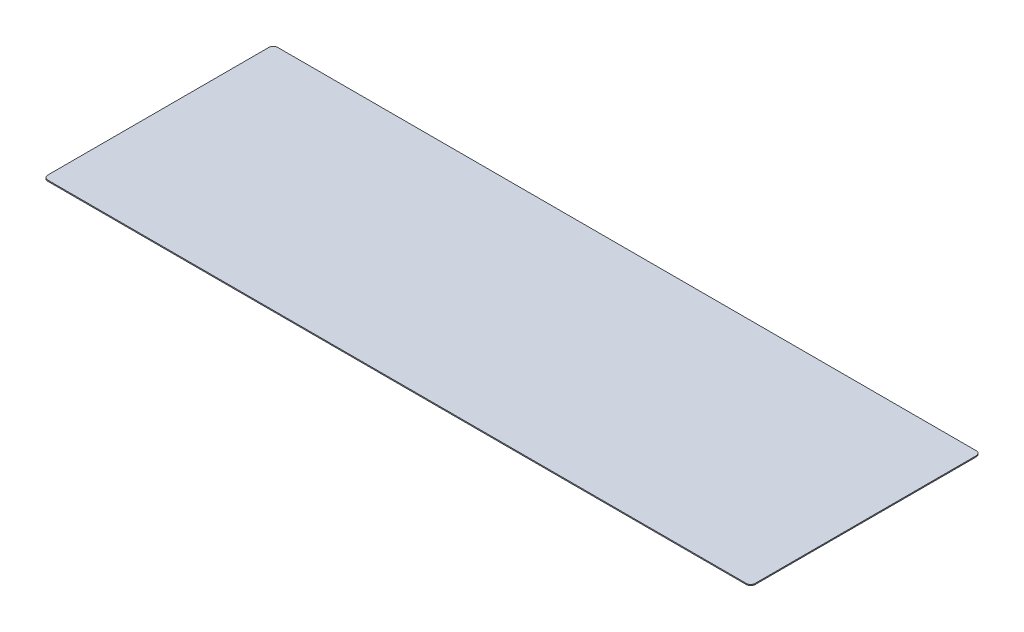
ISO-10303-21;
HEADER;
FILE_DESCRIPTION(('STEP AP214'),'2;1');
FILE_NAME('part.step','',(''),(''),'','','');
FILE_SCHEMA(('AUTOMOTIVE_DESIGN { 1 0 10303 214 1 1 1 1 }'));
ENDSEC;
DATA;
#1=APPLICATION_CONTEXT('core data for automotive mechanical design processes');
#2=APPLICATION_PROTOCOL_DEFINITION('international standard','automotive_design',2000,#1);
#3=PRODUCT_CONTEXT('',#1,'mechanical');
#4=PRODUCT('Part','Part','',(#3));
#5=PRODUCT_RELATED_PRODUCT_CATEGORY('part','',(#4));
#6=PRODUCT_DEFINITION_FORMATION('','',#4);
#7=PRODUCT_DEFINITION_CONTEXT('part definition',#1,'design');
#8=PRODUCT_DEFINITION('design','',#6,#7);
#9=PRODUCT_DEFINITION_SHAPE('','',#8);
#10=(LENGTH_UNIT() NAMED_UNIT(*) SI_UNIT(.MILLI.,.METRE.));
#11=(NAMED_UNIT(*) PLANE_ANGLE_UNIT() SI_UNIT($,.RADIAN.));
#12=(NAMED_UNIT(*) SI_UNIT($,.STERADIAN.) SOLID_ANGLE_UNIT());
#13=UNCERTAINTY_MEASURE_WITH_UNIT(LENGTH_MEASURE(1.E-05),#10,'distance_accuracy_value','');
#14=(GEOMETRIC_REPRESENTATION_CONTEXT(3) GLOBAL_UNCERTAINTY_ASSIGNED_CONTEXT((#13)) GLOBAL_UNIT_ASSIGNED_CONTEXT((#10,
#11,#12)) REPRESENTATION_CONTEXT('',''));
#15=CARTESIAN_POINT('',(0.,0.,0.));
#16=DIRECTION('',(0.,0.,1.));
#17=DIRECTION('',(1.,0.,0.));
#18=AXIS2_PLACEMENT_3D('',#15,#16,#17);
#19=CARTESIAN_POINT('',(1009.65,1.524,-323.85));
#20=DIRECTION('',(0.,-1.,0.));
#21=DIRECTION('',(0.,0.,-1.));
#22=AXIS2_PLACEMENT_3D('',#19,#20,#21);
#23=CYLINDRICAL_SURFACE('',#22,6.35000000000005);
#24=CARTESIAN_POINT('',(1009.65,0.,-323.85));
#25=DIRECTION('',(0.,1.,0.));
#26=DIRECTION('',(0.,0.,-1.));
#27=AXIS2_PLACEMENT_3D('',#24,#25,#26);
#28=CIRCLE('',#27,6.35000000000005);
#29=CARTESIAN_POINT('',(1016.,0.,-323.85));
#30=VERTEX_POINT('',#29);
#31=CARTESIAN_POINT('',(1009.65,0.,-330.2));
#32=VERTEX_POINT('',#31);
#33=EDGE_CURVE('E129',#30,#32,#28,.T.);
#34=ORIENTED_EDGE('',*,*,#33,.T.);
#35=DIRECTION('',(0.,-1.,0.));
#36=VECTOR('',#35,1.);
#37=CARTESIAN_POINT('',(1009.65,1.524,-330.2));
#38=LINE('',#37,#36);
#39=CARTESIAN_POINT('',(1009.65,1.524,-330.2));
#40=VERTEX_POINT('',#39);
#41=EDGE_CURVE('E11',#40,#32,#38,.T.);
#42=ORIENTED_EDGE('',*,*,#41,.F.);
#43=CARTESIAN_POINT('',(1009.65,1.524,-323.85));
#44=DIRECTION('',(0.,1.,0.));
#45=DIRECTION('',(0.,0.,-1.));
#46=AXIS2_PLACEMENT_3D('',#43,#44,#45);
#47=CIRCLE('',#46,6.35000000000005);
#48=CARTESIAN_POINT('',(1016.,1.524,-323.85));
#49=VERTEX_POINT('',#48);
#50=EDGE_CURVE('E143',#49,#40,#47,.T.);
#51=ORIENTED_EDGE('',*,*,#50,.F.);
#52=DIRECTION('',(0.,-1.,0.));
#53=VECTOR('',#52,1.);
#54=CARTESIAN_POINT('',(1016.,1.524,-323.85));
#55=LINE('',#54,#53);
#56=EDGE_CURVE('E125',#49,#30,#55,.T.);
#57=ORIENTED_EDGE('',*,*,#56,.T.);
#58=EDGE_LOOP('',(#34,#42,#51,#57));
#59=FACE_BOUND('',#58,.T.);
#60=ADVANCED_FACE('F33',(#59),#23,.T.);
#61=CARTESIAN_POINT('',(6.35000000000004,1.524,-330.2));
#62=DIRECTION('',(0.,0.,1.));
#63=DIRECTION('',(1.,0.,0.));
#64=AXIS2_PLACEMENT_3D('',#61,#62,#63);
#65=PLANE('',#64);
#66=DIRECTION('',(-1.,0.,0.));
#67=VECTOR('',#66,1.);
#68=CARTESIAN_POINT('',(6.35000000000004,0.,-330.2));
#69=LINE('',#68,#67);
#70=CARTESIAN_POINT('',(6.35000000000004,0.,-330.2));
#71=VERTEX_POINT('',#70);
#72=EDGE_CURVE('E132',#32,#71,#69,.T.);
#73=ORIENTED_EDGE('',*,*,#72,.T.);
#74=DIRECTION('',(0.,-1.,0.));
#75=VECTOR('',#74,1.);
#76=CARTESIAN_POINT('',(6.35000000000004,1.524,-330.2));
#77=LINE('',#76,#75);
#78=CARTESIAN_POINT('',(6.35000000000004,1.524,-330.2));
#79=VERTEX_POINT('',#78);
#80=EDGE_CURVE('E41',#79,#71,#77,.T.);
#81=ORIENTED_EDGE('',*,*,#80,.F.);
#82=DIRECTION('',(-1.,0.,0.));
#83=VECTOR('',#82,1.);
#84=CARTESIAN_POINT('',(6.35000000000004,1.524,-330.2));
#85=LINE('',#84,#83);
#86=EDGE_CURVE('E92',#40,#79,#85,.T.);
#87=ORIENTED_EDGE('',*,*,#86,.F.);
#88=ORIENTED_EDGE('',*,*,#41,.T.);
#89=EDGE_LOOP('',(#73,#81,#87,#88));
#90=FACE_BOUND('',#89,.T.);
#91=ADVANCED_FACE('F178',(#90),#65,.F.);
#92=CARTESIAN_POINT('',(6.35,1.524,-323.85));
#93=DIRECTION('',(0.,-1.,0.));
#94=DIRECTION('',(0.,0.,-1.));
#95=AXIS2_PLACEMENT_3D('',#92,#93,#94);
#96=CYLINDRICAL_SURFACE('',#95,6.35000000000001);
#97=CARTESIAN_POINT('',(6.35,0.,-323.85));
#98=DIRECTION('',(0.,1.,0.));
#99=DIRECTION('',(0.,0.,-1.));
#100=AXIS2_PLACEMENT_3D('',#97,#98,#99);
#101=CIRCLE('',#100,6.35000000000001);
#102=CARTESIAN_POINT('',(0.,0.,-323.85));
#103=VERTEX_POINT('',#102);
#104=EDGE_CURVE('E134',#71,#103,#101,.T.);
#105=ORIENTED_EDGE('',*,*,#104,.T.);
#106=DIRECTION('',(0.,-1.,0.));
#107=VECTOR('',#106,1.);
#108=CARTESIAN_POINT('',(0.,1.524,-323.85));
#109=LINE('',#108,#107);
#110=CARTESIAN_POINT('',(0.,1.524,-323.85));
#111=VERTEX_POINT('',#110);
#112=EDGE_CURVE('E150',#111,#103,#109,.T.);
#113=ORIENTED_EDGE('',*,*,#112,.F.);
#114=CARTESIAN_POINT('',(6.35,1.524,-323.85));
#115=DIRECTION('',(0.,1.,0.));
#116=DIRECTION('',(0.,0.,-1.));
#117=AXIS2_PLACEMENT_3D('',#114,#115,#116);
#118=CIRCLE('',#117,6.35000000000001);
#119=EDGE_CURVE('E158',#79,#111,#118,.T.);
#120=ORIENTED_EDGE('',*,*,#119,.F.);
#121=ORIENTED_EDGE('',*,*,#80,.T.);
#122=EDGE_LOOP('',(#105,#113,#120,#121));
#123=FACE_BOUND('',#122,.T.);
#124=ADVANCED_FACE('F156',(#123),#96,.T.);
#125=CARTESIAN_POINT('',(0.,1.524,-6.35000000000004));
#126=DIRECTION('',(1.,0.,0.));
#127=DIRECTION('',(0.,0.,-1.));
#128=AXIS2_PLACEMENT_3D('',#125,#126,#127);
#129=PLANE('',#128);
#130=DIRECTION('',(0.,0.,1.));
#131=VECTOR('',#130,1.);
#132=CARTESIAN_POINT('',(0.,0.,-6.35000000000004));
#133=LINE('',#132,#131);
#134=CARTESIAN_POINT('',(0.,0.,-6.35000000000004));
#135=VERTEX_POINT('',#134);
#136=EDGE_CURVE('E136',#103,#135,#133,.T.);
#137=ORIENTED_EDGE('',*,*,#136,.T.);
#138=DIRECTION('',(0.,-1.,0.));
#139=VECTOR('',#138,1.);
#140=CARTESIAN_POINT('',(0.,1.524,-6.35000000000004));
#141=LINE('',#140,#139);
#142=CARTESIAN_POINT('',(0.,1.524,-6.35000000000004));
#143=VERTEX_POINT('',#142);
#144=EDGE_CURVE('E147',#143,#135,#141,.T.);
#145=ORIENTED_EDGE('',*,*,#144,.F.);
#146=DIRECTION('',(0.,0.,1.));
#147=VECTOR('',#146,1.);
#148=CARTESIAN_POINT('',(0.,1.524,-6.35000000000004));
#149=LINE('',#148,#147);
#150=EDGE_CURVE('E170',#111,#143,#149,.T.);
#151=ORIENTED_EDGE('',*,*,#150,.F.);
#152=ORIENTED_EDGE('',*,*,#112,.T.);
#153=EDGE_LOOP('',(#137,#145,#151,#152));
#154=FACE_BOUND('',#153,.T.);
#155=ADVANCED_FACE('F166',(#154),#129,.F.);
#156=CARTESIAN_POINT('',(6.35,1.524,-6.35));
#157=DIRECTION('',(0.,-1.,0.));
#158=DIRECTION('',(0.,0.,-1.));
#159=AXIS2_PLACEMENT_3D('',#156,#157,#158);
#160=CYLINDRICAL_SURFACE('',#159,6.35);
#161=CARTESIAN_POINT('',(6.35,0.,-6.35));
#162=DIRECTION('',(0.,1.,0.));
#163=DIRECTION('',(0.,0.,-1.));
#164=AXIS2_PLACEMENT_3D('',#161,#162,#163);
#165=CIRCLE('',#164,6.35);
#166=CARTESIAN_POINT('',(6.35000000000005,0.,0.));
#167=VERTEX_POINT('',#166);
#168=EDGE_CURVE('E138',#135,#167,#165,.T.);
#169=ORIENTED_EDGE('',*,*,#168,.T.);
#170=DIRECTION('',(0.,-1.,0.));
#171=VECTOR('',#170,1.);
#172=CARTESIAN_POINT('',(6.35000000000005,1.524,0.));
#173=LINE('',#172,#171);
#174=CARTESIAN_POINT('',(6.35000000000005,1.524,0.));
#175=VERTEX_POINT('',#174);
#176=EDGE_CURVE('E120',#175,#167,#173,.T.);
#177=ORIENTED_EDGE('',*,*,#176,.F.);
#178=CARTESIAN_POINT('',(6.35,1.524,-6.35));
#179=DIRECTION('',(0.,1.,0.));
#180=DIRECTION('',(0.,0.,-1.));
#181=AXIS2_PLACEMENT_3D('',#178,#179,#180);
#182=CIRCLE('',#181,6.35);
#183=EDGE_CURVE('E111',#143,#175,#182,.T.);
#184=ORIENTED_EDGE('',*,*,#183,.F.);
#185=ORIENTED_EDGE('',*,*,#144,.T.);
#186=EDGE_LOOP('',(#169,#177,#184,#185));
#187=FACE_BOUND('',#186,.T.);
#188=ADVANCED_FACE('F169',(#187),#160,.T.);
#189=CARTESIAN_POINT('',(6.35000000000004,1.524,0.));
#190=DIRECTION('',(0.,0.,-1.));
#191=DIRECTION('',(-1.,0.,0.));
#192=AXIS2_PLACEMENT_3D('',#189,#190,#191);
#193=PLANE('',#192);
#194=DIRECTION('',(1.,0.,0.));
#195=VECTOR('',#194,1.);
#196=CARTESIAN_POINT('',(6.35000000000004,0.,0.));
#197=LINE('',#196,#195);
#198=CARTESIAN_POINT('',(1009.65,0.,0.));
#199=VERTEX_POINT('',#198);
#200=EDGE_CURVE('E119',#167,#199,#197,.T.);
#201=ORIENTED_EDGE('',*,*,#200,.T.);
#202=DIRECTION('',(0.,-1.,0.));
#203=VECTOR('',#202,1.);
#204=CARTESIAN_POINT('',(1009.65,1.524,0.));
#205=LINE('',#204,#203);
#206=CARTESIAN_POINT('',(1009.65,1.524,0.));
#207=VERTEX_POINT('',#206);
#208=EDGE_CURVE('E116',#207,#199,#205,.T.);
#209=ORIENTED_EDGE('',*,*,#208,.F.);
#210=DIRECTION('',(1.,0.,0.));
#211=VECTOR('',#210,1.);
#212=CARTESIAN_POINT('',(6.35000000000004,1.524,0.));
#213=LINE('',#212,#211);
#214=EDGE_CURVE('E105',#175,#207,#213,.T.);
#215=ORIENTED_EDGE('',*,*,#214,.F.);
#216=ORIENTED_EDGE('',*,*,#176,.T.);
#217=EDGE_LOOP('',(#201,#209,#215,#216));
#218=FACE_BOUND('',#217,.T.);
#219=ADVANCED_FACE('F117',(#218),#193,.F.);
#220=CARTESIAN_POINT('',(1009.65,1.524,-6.35));
#221=DIRECTION('',(0.,-1.,0.));
#222=DIRECTION('',(0.,0.,-1.));
#223=AXIS2_PLACEMENT_3D('',#220,#221,#222);
#224=CYLINDRICAL_SURFACE('',#223,6.35000000000004);
#225=CARTESIAN_POINT('',(1009.65,0.,-6.35));
#226=DIRECTION('',(0.,1.,0.));
#227=DIRECTION('',(0.,0.,1.));
#228=AXIS2_PLACEMENT_3D('',#225,#226,#227);
#229=CIRCLE('',#228,6.35000000000004);
#230=CARTESIAN_POINT('',(1016.,0.,-6.35));
#231=VERTEX_POINT('',#230);
#232=EDGE_CURVE('E78',#199,#231,#229,.T.);
#233=ORIENTED_EDGE('',*,*,#232,.T.);
#234=DIRECTION('',(0.,-1.,0.));
#235=VECTOR('',#234,1.);
#236=CARTESIAN_POINT('',(1016.,1.524,-6.35));
#237=LINE('',#236,#235);
#238=CARTESIAN_POINT('',(1016.,1.524,-6.35));
#239=VERTEX_POINT('',#238);
#240=EDGE_CURVE('E121',#239,#231,#237,.T.);
#241=ORIENTED_EDGE('',*,*,#240,.F.);
#242=CARTESIAN_POINT('',(1009.65,1.524,-6.35));
#243=DIRECTION('',(0.,1.,0.));
#244=DIRECTION('',(0.,0.,1.));
#245=AXIS2_PLACEMENT_3D('',#242,#243,#244);
#246=CIRCLE('',#245,6.35000000000004);
#247=EDGE_CURVE('E109',#207,#239,#246,.T.);
#248=ORIENTED_EDGE('',*,*,#247,.F.);
#249=ORIENTED_EDGE('',*,*,#208,.T.);
#250=EDGE_LOOP('',(#233,#241,#248,#249));
#251=FACE_BOUND('',#250,.T.);
#252=ADVANCED_FACE('F123',(#251),#224,.T.);
#253=CARTESIAN_POINT('',(1016.,1.524,-6.35));
#254=DIRECTION('',(-1.,0.,0.));
#255=DIRECTION('',(0.,0.,1.));
#256=AXIS2_PLACEMENT_3D('',#253,#254,#255);
#257=PLANE('',#256);
#258=DIRECTION('',(0.,0.,-1.));
#259=VECTOR('',#258,1.);
#260=CARTESIAN_POINT('',(1016.,0.,-6.35));
#261=LINE('',#260,#259);
#262=EDGE_CURVE('E84',#231,#30,#261,.T.);
#263=ORIENTED_EDGE('',*,*,#262,.T.);
#264=ORIENTED_EDGE('',*,*,#56,.F.);
#265=DIRECTION('',(0.,0.,-1.));
#266=VECTOR('',#265,1.);
#267=CARTESIAN_POINT('',(1016.,1.524,-6.35));
#268=LINE('',#267,#266);
#269=EDGE_CURVE('E49',#239,#49,#268,.T.);
#270=ORIENTED_EDGE('',*,*,#269,.F.);
#271=ORIENTED_EDGE('',*,*,#240,.T.);
#272=EDGE_LOOP('',(#263,#264,#270,#271));
#273=FACE_BOUND('',#272,.T.);
#274=ADVANCED_FACE('F194',(#273),#257,.F.);
#275=CARTESIAN_POINT('',(1009.65,1.524,-323.85));
#276=DIRECTION('',(0.,-1.,0.));
#277=DIRECTION('',(0.,0.,-1.));
#278=AXIS2_PLACEMENT_3D('',#275,#276,#277);
#279=PLANE('',#278);
#280=ORIENTED_EDGE('',*,*,#50,.T.);
#281=ORIENTED_EDGE('',*,*,#86,.T.);
#282=ORIENTED_EDGE('',*,*,#119,.T.);
#283=ORIENTED_EDGE('',*,*,#150,.T.);
#284=ORIENTED_EDGE('',*,*,#183,.T.);
#285=ORIENTED_EDGE('',*,*,#214,.T.);
#286=ORIENTED_EDGE('',*,*,#247,.T.);
#287=ORIENTED_EDGE('',*,*,#269,.T.);
#288=EDGE_LOOP('',(#280,#281,#282,#283,#284,#285,#286,#287));
#289=FACE_BOUND('',#288,.T.);
#290=ADVANCED_FACE('F107',(#289),#279,.F.);
#291=CARTESIAN_POINT('',(1009.65,0.,-323.85));
#292=DIRECTION('',(0.,-1.,0.));
#293=DIRECTION('',(0.,0.,-1.));
#294=AXIS2_PLACEMENT_3D('',#291,#292,#293);
#295=PLANE('',#294);
#296=ORIENTED_EDGE('',*,*,#33,.F.);
#297=ORIENTED_EDGE('',*,*,#262,.F.);
#298=ORIENTED_EDGE('',*,*,#232,.F.);
#299=ORIENTED_EDGE('',*,*,#200,.F.);
#300=ORIENTED_EDGE('',*,*,#168,.F.);
#301=ORIENTED_EDGE('',*,*,#136,.F.);
#302=ORIENTED_EDGE('',*,*,#104,.F.);
#303=ORIENTED_EDGE('',*,*,#72,.F.);
#304=EDGE_LOOP('',(#296,#297,#298,#299,#300,#301,#302,#303));
#305=FACE_BOUND('',#304,.T.);
#306=ADVANCED_FACE('F162',(#305),#295,.T.);
#307=CLOSED_SHELL('',(#60,#91,#124,#155,#188,#219,#252,#274,#290,#306));
#308=MANIFOLD_SOLID_BREP('B2',#307);
#309=ADVANCED_BREP_SHAPE_REPRESENTATION('',(#18,#308),#14);
#310=SHAPE_DEFINITION_REPRESENTATION(#9,#309);
ENDSEC;
END-ISO-10303-21;
